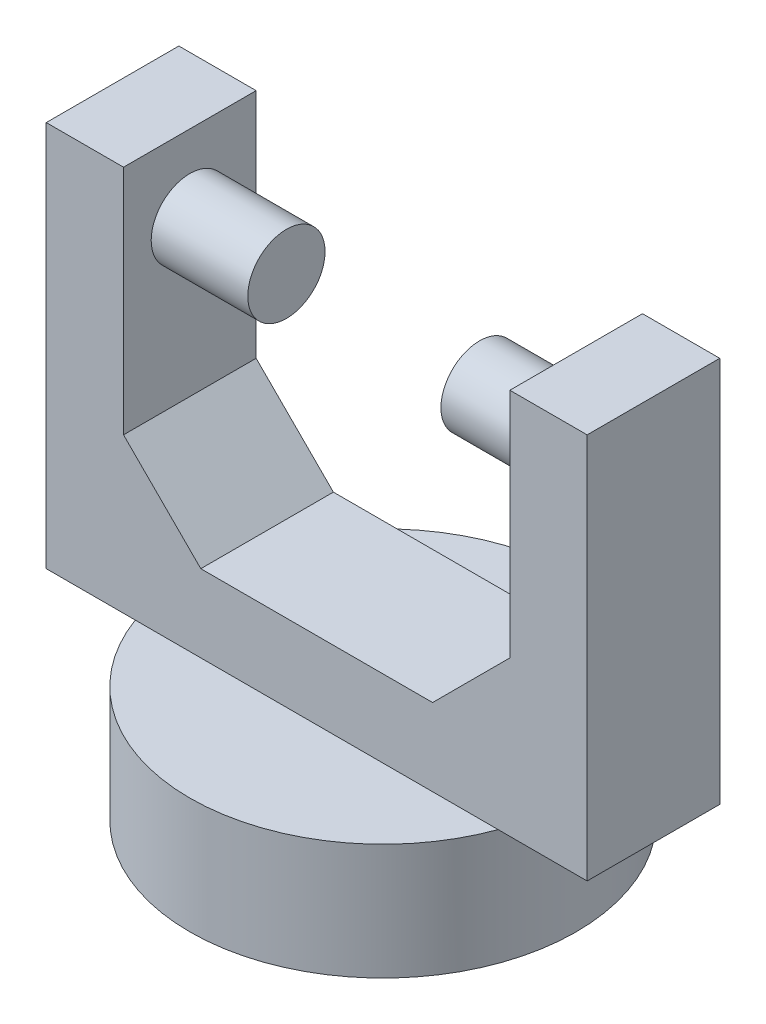
ISO-10303-21;
HEADER;
FILE_DESCRIPTION(('STEP AP214'),'2;1');
FILE_NAME('part.step','',(''),(''),'','','');
FILE_SCHEMA(('AUTOMOTIVE_DESIGN { 1 0 10303 214 1 1 1 1 }'));
ENDSEC;
DATA;
#1=APPLICATION_CONTEXT('core data for automotive mechanical design processes');
#2=APPLICATION_PROTOCOL_DEFINITION('international standard','automotive_design',2000,#1);
#3=PRODUCT_CONTEXT('',#1,'mechanical');
#4=PRODUCT('Part','Part','',(#3));
#5=PRODUCT_RELATED_PRODUCT_CATEGORY('part','',(#4));
#6=PRODUCT_DEFINITION_FORMATION('','',#4);
#7=PRODUCT_DEFINITION_CONTEXT('part definition',#1,'design');
#8=PRODUCT_DEFINITION('design','',#6,#7);
#9=PRODUCT_DEFINITION_SHAPE('','',#8);
#10=(LENGTH_UNIT() NAMED_UNIT(*) SI_UNIT(.MILLI.,.METRE.));
#11=(NAMED_UNIT(*) PLANE_ANGLE_UNIT() SI_UNIT($,.RADIAN.));
#12=(NAMED_UNIT(*) SI_UNIT($,.STERADIAN.) SOLID_ANGLE_UNIT());
#13=UNCERTAINTY_MEASURE_WITH_UNIT(LENGTH_MEASURE(1.E-05),#10,'distance_accuracy_value','');
#14=(GEOMETRIC_REPRESENTATION_CONTEXT(3) GLOBAL_UNCERTAINTY_ASSIGNED_CONTEXT((#13)) GLOBAL_UNIT_ASSIGNED_CONTEXT((#10,
#11,#12)) REPRESENTATION_CONTEXT('',''));
#15=CARTESIAN_POINT('',(0.,0.,0.));
#16=DIRECTION('',(0.,0.,1.));
#17=DIRECTION('',(1.,0.,0.));
#18=AXIS2_PLACEMENT_3D('',#15,#16,#17);
#19=CARTESIAN_POINT('',(0.,32.5,0.));
#20=DIRECTION('',(0.,1.,0.));
#21=DIRECTION('',(0.,0.,1.));
#22=AXIS2_PLACEMENT_3D('',#19,#20,#21);
#23=PLANE('',#22);
#24=DIRECTION('',(0.,0.,1.));
#25=VECTOR('',#24,1.);
#26=CARTESIAN_POINT('',(-12.5,32.5,-4.29038395748194));
#27=LINE('',#26,#25);
#28=CARTESIAN_POINT('',(-12.5,32.5,-4.29038395748194));
#29=VERTEX_POINT('',#28);
#30=CARTESIAN_POINT('',(-12.5,32.5,4.29038395748193));
#31=VERTEX_POINT('',#30);
#32=EDGE_CURVE('E142',#29,#31,#27,.T.);
#33=ORIENTED_EDGE('',*,*,#32,.F.);
#34=DIRECTION('',(-1.,0.,0.));
#35=VECTOR('',#34,1.);
#36=CARTESIAN_POINT('',(-17.5,32.5,-4.29038395748194));
#37=LINE('',#36,#35);
#38=CARTESIAN_POINT('',(-17.5,32.5,-4.29038395748194));
#39=VERTEX_POINT('',#38);
#40=EDGE_CURVE('E161',#29,#39,#37,.T.);
#41=ORIENTED_EDGE('',*,*,#40,.T.);
#42=DIRECTION('',(0.,0.,1.));
#43=VECTOR('',#42,1.);
#44=CARTESIAN_POINT('',(-17.5,32.5,-4.29038395748194));
#45=LINE('',#44,#43);
#46=CARTESIAN_POINT('',(-17.5,32.5,4.29038395748193));
#47=VERTEX_POINT('',#46);
#48=EDGE_CURVE('E153',#39,#47,#45,.T.);
#49=ORIENTED_EDGE('',*,*,#48,.T.);
#50=DIRECTION('',(1.,0.,0.));
#51=VECTOR('',#50,1.);
#52=CARTESIAN_POINT('',(-17.5,32.5,4.29038395748193));
#53=LINE('',#52,#51);
#54=EDGE_CURVE('E132',#47,#31,#53,.T.);
#55=ORIENTED_EDGE('',*,*,#54,.T.);
#56=EDGE_LOOP('',(#33,#41,#49,#55));
#57=FACE_BOUND('',#56,.T.);
#58=ADVANCED_FACE('F39',(#57),#23,.T.);
#59=CARTESIAN_POINT('',(0.,7.5,0.));
#60=DIRECTION('',(0.,1.,0.));
#61=DIRECTION('',(0.,0.,1.));
#62=AXIS2_PLACEMENT_3D('',#59,#60,#61);
#63=PLANE('',#62);
#64=DIRECTION('',(-1.,0.,0.));
#65=VECTOR('',#64,1.);
#66=CARTESIAN_POINT('',(-17.5,7.5,-4.29038395748194));
#67=LINE('',#66,#65);
#68=CARTESIAN_POINT('',(11.7406390583044,7.5,-4.29038395748194));
#69=VERTEX_POINT('',#68);
#70=CARTESIAN_POINT('',(-11.7406390583044,7.5,-4.29038395748194));
#71=VERTEX_POINT('',#70);
#72=EDGE_CURVE('E188',#69,#71,#67,.T.);
#73=ORIENTED_EDGE('',*,*,#72,.F.);
#74=CARTESIAN_POINT('',(0.,7.5,0.));
#75=DIRECTION('',(0.,1.,0.));
#76=DIRECTION('',(0.,0.,1.));
#77=AXIS2_PLACEMENT_3D('',#74,#75,#76);
#78=CIRCLE('',#77,12.5);
#79=EDGE_CURVE('E208',#69,#71,#78,.T.);
#80=ORIENTED_EDGE('',*,*,#79,.T.);
#81=EDGE_LOOP('',(#73,#80));
#82=FACE_BOUND('',#81,.T.);
#83=ADVANCED_FACE('F318',(#82),#63,.T.);
#84=CARTESIAN_POINT('',(0.,7.5,0.));
#85=DIRECTION('',(0.,-1.,0.));
#86=DIRECTION('',(0.,0.,-1.));
#87=AXIS2_PLACEMENT_3D('',#84,#85,#86);
#88=CYLINDRICAL_SURFACE('',#87,12.5);
#89=CARTESIAN_POINT('',(11.7406390583043,7.5,4.29038395748194));
#90=VERTEX_POINT('',#89);
#91=EDGE_CURVE('E204',#90,#69,#78,.T.);
#92=ORIENTED_EDGE('',*,*,#91,.F.);
#93=CARTESIAN_POINT('',(-11.7406390583044,7.5,4.29038395748193));
#94=VERTEX_POINT('',#93);
#95=EDGE_CURVE('E209',#94,#90,#78,.T.);
#96=ORIENTED_EDGE('',*,*,#95,.F.);
#97=EDGE_CURVE('E247',#71,#94,#78,.T.);
#98=ORIENTED_EDGE('',*,*,#97,.F.);
#99=ORIENTED_EDGE('',*,*,#79,.F.);
#100=EDGE_LOOP('',(#92,#96,#98,#99));
#101=FACE_BOUND('',#100,.T.);
#102=CARTESIAN_POINT('',(0.,0.,0.));
#103=DIRECTION('',(0.,1.,0.));
#104=DIRECTION('',(0.,0.,1.));
#105=AXIS2_PLACEMENT_3D('',#102,#103,#104);
#106=CIRCLE('',#105,12.5);
#107=CARTESIAN_POINT('',(0.,0.,12.5));
#108=VERTEX_POINT('',#107);
#109=EDGE_CURVE('E203',#108,#108,#106,.T.);
#110=ORIENTED_EDGE('',*,*,#109,.T.);
#111=EDGE_LOOP('',(#110));
#112=FACE_BOUND('',#111,.T.);
#113=ADVANCED_FACE('F324',(#101,#112),#88,.T.);
#114=DIRECTION('',(1.,0.,0.));
#115=VECTOR('',#114,1.);
#116=CARTESIAN_POINT('',(-17.5,7.5,4.29038395748193));
#117=LINE('',#116,#115);
#118=EDGE_CURVE('E180',#94,#90,#117,.T.);
#119=ORIENTED_EDGE('',*,*,#118,.F.);
#120=ORIENTED_EDGE('',*,*,#95,.T.);
#121=EDGE_LOOP('',(#119,#120));
#122=FACE_BOUND('',#121,.T.);
#123=ADVANCED_FACE('F327',(#122),#63,.T.);
#124=CARTESIAN_POINT('',(0.,0.,0.));
#125=DIRECTION('',(0.,1.,0.));
#126=DIRECTION('',(0.,0.,1.));
#127=AXIS2_PLACEMENT_3D('',#124,#125,#126);
#128=PLANE('',#127);
#129=ORIENTED_EDGE('',*,*,#109,.F.);
#130=EDGE_LOOP('',(#129));
#131=FACE_BOUND('',#130,.T.);
#132=ADVANCED_FACE('F361',(#131),#128,.F.);
#133=CARTESIAN_POINT('',(0.,7.5,0.));
#134=DIRECTION('',(0.,1.,0.));
#135=DIRECTION('',(0.,0.,1.));
#136=AXIS2_PLACEMENT_3D('',#133,#134,#135);
#137=PLANE('',#136);
#138=CARTESIAN_POINT('',(17.5,7.5,4.29038395748194));
#139=VERTEX_POINT('',#138);
#140=EDGE_CURVE('E174',#90,#139,#117,.T.);
#141=ORIENTED_EDGE('',*,*,#140,.F.);
#142=ORIENTED_EDGE('',*,*,#91,.T.);
#143=CARTESIAN_POINT('',(17.5,7.5,-4.29038395748194));
#144=VERTEX_POINT('',#143);
#145=EDGE_CURVE('E184',#144,#69,#67,.T.);
#146=ORIENTED_EDGE('',*,*,#145,.F.);
#147=DIRECTION('',(0.,0.,-1.));
#148=VECTOR('',#147,1.);
#149=CARTESIAN_POINT('',(17.5,7.5,-4.29038395748194));
#150=LINE('',#149,#148);
#151=EDGE_CURVE('E179',#139,#144,#150,.T.);
#152=ORIENTED_EDGE('',*,*,#151,.F.);
#153=EDGE_LOOP('',(#141,#142,#146,#152));
#154=FACE_BOUND('',#153,.T.);
#155=ADVANCED_FACE('F347',(#154),#137,.F.);
#156=CARTESIAN_POINT('',(-17.5,7.5,-4.29038395748194));
#157=VERTEX_POINT('',#156);
#158=EDGE_CURVE('E183',#71,#157,#67,.T.);
#159=ORIENTED_EDGE('',*,*,#158,.F.);
#160=ORIENTED_EDGE('',*,*,#97,.T.);
#161=CARTESIAN_POINT('',(-17.5,7.5,4.29038395748193));
#162=VERTEX_POINT('',#161);
#163=EDGE_CURVE('E175',#162,#94,#117,.T.);
#164=ORIENTED_EDGE('',*,*,#163,.F.);
#165=DIRECTION('',(0.,0.,1.));
#166=VECTOR('',#165,1.);
#167=CARTESIAN_POINT('',(-17.5,7.5,-4.29038395748194));
#168=LINE('',#167,#166);
#169=EDGE_CURVE('E170',#157,#162,#168,.T.);
#170=ORIENTED_EDGE('',*,*,#169,.F.);
#171=EDGE_LOOP('',(#159,#160,#164,#170));
#172=FACE_BOUND('',#171,.T.);
#173=ADVANCED_FACE('F354',(#172),#137,.F.);
#174=CARTESIAN_POINT('',(-17.5,32.5,-4.29038395748194));
#175=DIRECTION('',(1.,0.,0.));
#176=DIRECTION('',(0.,0.,-1.));
#177=AXIS2_PLACEMENT_3D('',#174,#175,#176);
#178=PLANE('',#177);
#179=ORIENTED_EDGE('',*,*,#169,.T.);
#180=DIRECTION('',(0.,-1.,0.));
#181=VECTOR('',#180,1.);
#182=CARTESIAN_POINT('',(-17.5,32.5,4.29038395748193));
#183=LINE('',#182,#181);
#184=EDGE_CURVE('E200',#47,#162,#183,.T.);
#185=ORIENTED_EDGE('',*,*,#184,.F.);
#186=ORIENTED_EDGE('',*,*,#48,.F.);
#187=DIRECTION('',(0.,-1.,0.));
#188=VECTOR('',#187,1.);
#189=CARTESIAN_POINT('',(-17.5,32.5,-4.29038395748194));
#190=LINE('',#189,#188);
#191=EDGE_CURVE('E169',#39,#157,#190,.T.);
#192=ORIENTED_EDGE('',*,*,#191,.T.);
#193=EDGE_LOOP('',(#179,#185,#186,#192));
#194=FACE_BOUND('',#193,.T.);
#195=ADVANCED_FACE('F257',(#194),#178,.F.);
#196=CARTESIAN_POINT('',(-17.5,32.5,4.29038395748193));
#197=DIRECTION('',(0.,0.,-1.));
#198=DIRECTION('',(-1.,0.,0.));
#199=AXIS2_PLACEMENT_3D('',#196,#197,#198);
#200=PLANE('',#199);
#201=DIRECTION('',(1.,0.,0.));
#202=VECTOR('',#201,1.);
#203=CARTESIAN_POINT('',(-12.5,12.5,4.29038395748193));
#204=LINE('',#203,#202);
#205=CARTESIAN_POINT('',(-7.49999999999997,12.5,4.29038395748193));
#206=VERTEX_POINT('',#205);
#207=CARTESIAN_POINT('',(7.49999999999997,12.5,4.29038395748193));
#208=VERTEX_POINT('',#207);
#209=EDGE_CURVE('E270',#206,#208,#204,.T.);
#210=ORIENTED_EDGE('',*,*,#209,.F.);
#211=DIRECTION('',(-0.707106781186551,0.707106781186544,0.));
#212=VECTOR('',#211,1.);
#213=CARTESIAN_POINT('',(-22.5,27.4999999999999,4.29038395748193));
#214=LINE('',#213,#212);
#215=CARTESIAN_POINT('',(-12.5,17.5,4.29038395748193));
#216=VERTEX_POINT('',#215);
#217=EDGE_CURVE('E134',#206,#216,#214,.T.);
#218=ORIENTED_EDGE('',*,*,#217,.T.);
#219=DIRECTION('',(0.,1.,0.));
#220=VECTOR('',#219,1.);
#221=CARTESIAN_POINT('',(-12.5,12.5,4.29038395748193));
#222=LINE('',#221,#220);
#223=EDGE_CURVE('E126',#216,#31,#222,.T.);
#224=ORIENTED_EDGE('',*,*,#223,.T.);
#225=ORIENTED_EDGE('',*,*,#54,.F.);
#226=ORIENTED_EDGE('',*,*,#184,.T.);
#227=ORIENTED_EDGE('',*,*,#163,.T.);
#228=ORIENTED_EDGE('',*,*,#118,.T.);
#229=ORIENTED_EDGE('',*,*,#140,.T.);
#230=DIRECTION('',(0.,-1.,0.));
#231=VECTOR('',#230,1.);
#232=CARTESIAN_POINT('',(17.5,32.5,4.29038395748194));
#233=LINE('',#232,#231);
#234=CARTESIAN_POINT('',(17.5,32.5,4.29038395748194));
#235=VERTEX_POINT('',#234);
#236=EDGE_CURVE('E196',#235,#139,#233,.T.);
#237=ORIENTED_EDGE('',*,*,#236,.F.);
#238=CARTESIAN_POINT('',(12.5,32.5,4.29038395748194));
#239=VERTEX_POINT('',#238);
#240=EDGE_CURVE('E157',#239,#235,#53,.T.);
#241=ORIENTED_EDGE('',*,*,#240,.F.);
#242=DIRECTION('',(0.,1.,0.));
#243=VECTOR('',#242,1.);
#244=CARTESIAN_POINT('',(12.5,12.5,4.29038395748193));
#245=LINE('',#244,#243);
#246=CARTESIAN_POINT('',(12.5,17.5,4.29038395748193));
#247=VERTEX_POINT('',#246);
#248=EDGE_CURVE('E138',#247,#239,#245,.T.);
#249=ORIENTED_EDGE('',*,*,#248,.F.);
#250=DIRECTION('',(-0.707106781186551,-0.707106781186544,0.));
#251=VECTOR('',#250,1.);
#252=CARTESIAN_POINT('',(4.99999999999987,9.99999999999991,4.29038395748193));
#253=LINE('',#252,#251);
#254=EDGE_CURVE('E11',#247,#208,#253,.T.);
#255=ORIENTED_EDGE('',*,*,#254,.T.);
#256=EDGE_LOOP('',(#210,#218,#224,#225,#226,#227,#228,#229,#237,#241,#249,#255));
#257=FACE_BOUND('',#256,.T.);
#258=ADVANCED_FACE('F129',(#257),#200,.F.);
#259=CARTESIAN_POINT('',(17.5,32.5,-4.29038395748194));
#260=DIRECTION('',(-1.,0.,0.));
#261=DIRECTION('',(0.,0.,1.));
#262=AXIS2_PLACEMENT_3D('',#259,#260,#261);
#263=PLANE('',#262);
#264=ORIENTED_EDGE('',*,*,#151,.T.);
#265=DIRECTION('',(0.,-1.,0.));
#266=VECTOR('',#265,1.);
#267=CARTESIAN_POINT('',(17.5,32.5,-4.29038395748194));
#268=LINE('',#267,#266);
#269=CARTESIAN_POINT('',(17.5,32.5,-4.29038395748194));
#270=VERTEX_POINT('',#269);
#271=EDGE_CURVE('E192',#270,#144,#268,.T.);
#272=ORIENTED_EDGE('',*,*,#271,.F.);
#273=DIRECTION('',(0.,0.,-1.));
#274=VECTOR('',#273,1.);
#275=CARTESIAN_POINT('',(17.5,32.5,-4.29038395748194));
#276=LINE('',#275,#274);
#277=EDGE_CURVE('E156',#235,#270,#276,.T.);
#278=ORIENTED_EDGE('',*,*,#277,.F.);
#279=ORIENTED_EDGE('',*,*,#236,.T.);
#280=EDGE_LOOP('',(#264,#272,#278,#279));
#281=FACE_BOUND('',#280,.T.);
#282=ADVANCED_FACE('F337',(#281),#263,.F.);
#283=CARTESIAN_POINT('',(-17.5,32.5,-4.29038395748194));
#284=DIRECTION('',(0.,0.,1.));
#285=DIRECTION('',(1.,0.,0.));
#286=AXIS2_PLACEMENT_3D('',#283,#284,#285);
#287=PLANE('',#286);
#288=ORIENTED_EDGE('',*,*,#40,.F.);
#289=DIRECTION('',(0.,1.,0.));
#290=VECTOR('',#289,1.);
#291=CARTESIAN_POINT('',(-12.5,12.5,-4.29038395748194));
#292=LINE('',#291,#290);
#293=CARTESIAN_POINT('',(-12.5,17.5,-4.29038395748194));
#294=VERTEX_POINT('',#293);
#295=EDGE_CURVE('E145',#294,#29,#292,.T.);
#296=ORIENTED_EDGE('',*,*,#295,.F.);
#297=DIRECTION('',(0.707106781186551,-0.707106781186544,0.));
#298=VECTOR('',#297,1.);
#299=CARTESIAN_POINT('',(-22.5,27.4999999999999,-4.29038395748194));
#300=LINE('',#299,#298);
#301=CARTESIAN_POINT('',(-7.49999999999997,12.5,-4.29038395748194));
#302=VERTEX_POINT('',#301);
#303=EDGE_CURVE('E230',#294,#302,#300,.T.);
#304=ORIENTED_EDGE('',*,*,#303,.T.);
#305=DIRECTION('',(-1.,0.,0.));
#306=VECTOR('',#305,1.);
#307=CARTESIAN_POINT('',(-12.5,12.5,-4.29038395748194));
#308=LINE('',#307,#306);
#309=CARTESIAN_POINT('',(7.49999999999996,12.5,-4.29038395748194));
#310=VERTEX_POINT('',#309);
#311=EDGE_CURVE('E139',#310,#302,#308,.T.);
#312=ORIENTED_EDGE('',*,*,#311,.F.);
#313=DIRECTION('',(0.707106781186551,0.707106781186544,0.));
#314=VECTOR('',#313,1.);
#315=CARTESIAN_POINT('',(4.99999999999987,9.99999999999991,-4.29038395748194));
#316=LINE('',#315,#314);
#317=CARTESIAN_POINT('',(12.5,17.5,-4.29038395748194));
#318=VERTEX_POINT('',#317);
#319=EDGE_CURVE('E48',#310,#318,#316,.T.);
#320=ORIENTED_EDGE('',*,*,#319,.T.);
#321=DIRECTION('',(0.,1.,0.));
#322=VECTOR('',#321,1.);
#323=CARTESIAN_POINT('',(12.5,12.5,-4.29038395748194));
#324=LINE('',#323,#322);
#325=CARTESIAN_POINT('',(12.5,32.5,-4.29038395748194));
#326=VERTEX_POINT('',#325);
#327=EDGE_CURVE('E263',#318,#326,#324,.T.);
#328=ORIENTED_EDGE('',*,*,#327,.T.);
#329=EDGE_CURVE('E165',#270,#326,#37,.T.);
#330=ORIENTED_EDGE('',*,*,#329,.F.);
#331=ORIENTED_EDGE('',*,*,#271,.T.);
#332=ORIENTED_EDGE('',*,*,#145,.T.);
#333=ORIENTED_EDGE('',*,*,#72,.T.);
#334=ORIENTED_EDGE('',*,*,#158,.T.);
#335=ORIENTED_EDGE('',*,*,#191,.F.);
#336=EDGE_LOOP('',(#288,#296,#304,#312,#320,#328,#330,#331,#332,#333,#334,#335));
#337=FACE_BOUND('',#336,.T.);
#338=ADVANCED_FACE('F253',(#337),#287,.F.);
#339=DIRECTION('',(0.,0.,-1.));
#340=VECTOR('',#339,1.);
#341=CARTESIAN_POINT('',(12.5,32.5,-4.29038395748194));
#342=LINE('',#341,#340);
#343=EDGE_CURVE('E149',#239,#326,#342,.T.);
#344=ORIENTED_EDGE('',*,*,#343,.F.);
#345=ORIENTED_EDGE('',*,*,#240,.T.);
#346=ORIENTED_EDGE('',*,*,#277,.T.);
#347=ORIENTED_EDGE('',*,*,#329,.T.);
#348=EDGE_LOOP('',(#344,#345,#346,#347));
#349=FACE_BOUND('',#348,.T.);
#350=ADVANCED_FACE('F320',(#349),#23,.T.);
#351=CARTESIAN_POINT('',(-12.5,12.5,-4.29038395748194));
#352=DIRECTION('',(-1.,0.,0.));
#353=DIRECTION('',(0.,0.,1.));
#354=AXIS2_PLACEMENT_3D('',#351,#352,#353);
#355=PLANE('',#354);
#356=CARTESIAN_POINT('',(-12.5,27.5,0.));
#357=DIRECTION('',(-1.,0.,0.));
#358=DIRECTION('',(0.,0.,1.));
#359=AXIS2_PLACEMENT_3D('',#356,#357,#358);
#360=CIRCLE('',#359,2.5);
#361=CARTESIAN_POINT('',(-12.5,27.5,2.5));
#362=VERTEX_POINT('',#361);
#363=EDGE_CURVE('E213',#362,#362,#360,.F.);
#364=ORIENTED_EDGE('',*,*,#363,.F.);
#365=EDGE_LOOP('',(#364));
#366=FACE_BOUND('',#365,.T.);
#367=ORIENTED_EDGE('',*,*,#223,.F.);
#368=DIRECTION('',(0.,0.,-1.));
#369=VECTOR('',#368,1.);
#370=CARTESIAN_POINT('',(-12.5,17.5,-4.29038395748194));
#371=LINE('',#370,#369);
#372=EDGE_CURVE('E225',#216,#294,#371,.T.);
#373=ORIENTED_EDGE('',*,*,#372,.T.);
#374=ORIENTED_EDGE('',*,*,#295,.T.);
#375=ORIENTED_EDGE('',*,*,#32,.T.);
#376=EDGE_LOOP('',(#367,#373,#374,#375));
#377=FACE_BOUND('',#376,.T.);
#378=ADVANCED_FACE('F143',(#366,#377),#355,.F.);
#379=CARTESIAN_POINT('',(12.5,12.5,-4.29038395748194));
#380=DIRECTION('',(1.,0.,0.));
#381=DIRECTION('',(0.,0.,-1.));
#382=AXIS2_PLACEMENT_3D('',#379,#380,#381);
#383=PLANE('',#382);
#384=CARTESIAN_POINT('',(12.5,27.5,0.));
#385=DIRECTION('',(1.,0.,0.));
#386=DIRECTION('',(0.,0.,-1.));
#387=AXIS2_PLACEMENT_3D('',#384,#385,#386);
#388=CIRCLE('',#387,2.5);
#389=CARTESIAN_POINT('',(12.5,27.5,-2.5));
#390=VERTEX_POINT('',#389);
#391=EDGE_CURVE('E217',#390,#390,#388,.F.);
#392=ORIENTED_EDGE('',*,*,#391,.F.);
#393=EDGE_LOOP('',(#392));
#394=FACE_BOUND('',#393,.T.);
#395=ORIENTED_EDGE('',*,*,#327,.F.);
#396=DIRECTION('',(0.,0.,1.));
#397=VECTOR('',#396,1.);
#398=CARTESIAN_POINT('',(12.5,17.5,-4.29038395748194));
#399=LINE('',#398,#397);
#400=EDGE_CURVE('E55',#318,#247,#399,.T.);
#401=ORIENTED_EDGE('',*,*,#400,.T.);
#402=ORIENTED_EDGE('',*,*,#248,.T.);
#403=ORIENTED_EDGE('',*,*,#343,.T.);
#404=EDGE_LOOP('',(#395,#401,#402,#403));
#405=FACE_BOUND('',#404,.T.);
#406=ADVANCED_FACE('F295',(#394,#405),#383,.F.);
#407=CARTESIAN_POINT('',(0.,12.5,0.));
#408=DIRECTION('',(0.,1.,0.));
#409=DIRECTION('',(0.,0.,1.));
#410=AXIS2_PLACEMENT_3D('',#407,#408,#409);
#411=PLANE('',#410);
#412=ORIENTED_EDGE('',*,*,#209,.T.);
#413=DIRECTION('',(0.,0.,-1.));
#414=VECTOR('',#413,1.);
#415=CARTESIAN_POINT('',(7.49999999999997,12.5,0.));
#416=LINE('',#415,#414);
#417=EDGE_CURVE('E234',#208,#310,#416,.T.);
#418=ORIENTED_EDGE('',*,*,#417,.T.);
#419=ORIENTED_EDGE('',*,*,#311,.T.);
#420=DIRECTION('',(0.,0.,1.));
#421=VECTOR('',#420,1.);
#422=CARTESIAN_POINT('',(-7.49999999999997,12.5,0.));
#423=LINE('',#422,#421);
#424=EDGE_CURVE('E221',#302,#206,#423,.T.);
#425=ORIENTED_EDGE('',*,*,#424,.T.);
#426=EDGE_LOOP('',(#412,#418,#419,#425));
#427=FACE_BOUND('',#426,.T.);
#428=ADVANCED_FACE('F297',(#427),#411,.T.);
#429=CARTESIAN_POINT('',(-6.25,27.5,0.));
#430=DIRECTION('',(-1.,0.,0.));
#431=DIRECTION('',(0.,0.,1.));
#432=AXIS2_PLACEMENT_3D('',#429,#430,#431);
#433=CYLINDRICAL_SURFACE('',#432,2.5);
#434=CARTESIAN_POINT('',(-6.25,27.5,0.));
#435=DIRECTION('',(1.,0.,0.));
#436=DIRECTION('',(0.,0.,-1.));
#437=AXIS2_PLACEMENT_3D('',#434,#435,#436);
#438=CIRCLE('',#437,2.5);
#439=CARTESIAN_POINT('',(-6.25,27.5,-2.5));
#440=VERTEX_POINT('',#439);
#441=EDGE_CURVE('E150',#440,#440,#438,.T.);
#442=ORIENTED_EDGE('',*,*,#441,.F.);
#443=EDGE_LOOP('',(#442));
#444=FACE_BOUND('',#443,.T.);
#445=ORIENTED_EDGE('',*,*,#363,.T.);
#446=EDGE_LOOP('',(#445));
#447=FACE_BOUND('',#446,.T.);
#448=ADVANCED_FACE('F420',(#444,#447),#433,.T.);
#449=CARTESIAN_POINT('',(-6.25,27.5,0.));
#450=DIRECTION('',(1.,0.,0.));
#451=DIRECTION('',(0.,0.,-1.));
#452=AXIS2_PLACEMENT_3D('',#449,#450,#451);
#453=PLANE('',#452);
#454=ORIENTED_EDGE('',*,*,#441,.T.);
#455=EDGE_LOOP('',(#454));
#456=FACE_BOUND('',#455,.T.);
#457=ADVANCED_FACE('F291',(#456),#453,.T.);
#458=CARTESIAN_POINT('',(6.25,27.5,0.));
#459=DIRECTION('',(1.,0.,0.));
#460=DIRECTION('',(0.,0.,-1.));
#461=AXIS2_PLACEMENT_3D('',#458,#459,#460);
#462=CYLINDRICAL_SURFACE('',#461,2.5);
#463=CARTESIAN_POINT('',(6.25,27.5,0.));
#464=DIRECTION('',(-1.,0.,0.));
#465=DIRECTION('',(0.,0.,1.));
#466=AXIS2_PLACEMENT_3D('',#463,#464,#465);
#467=CIRCLE('',#466,2.5);
#468=CARTESIAN_POINT('',(6.25,27.5,2.5));
#469=VERTEX_POINT('',#468);
#470=EDGE_CURVE('E280',#469,#469,#467,.T.);
#471=ORIENTED_EDGE('',*,*,#470,.F.);
#472=EDGE_LOOP('',(#471));
#473=FACE_BOUND('',#472,.T.);
#474=ORIENTED_EDGE('',*,*,#391,.T.);
#475=EDGE_LOOP('',(#474));
#476=FACE_BOUND('',#475,.T.);
#477=ADVANCED_FACE('F288',(#473,#476),#462,.T.);
#478=CARTESIAN_POINT('',(6.25,27.5,0.));
#479=DIRECTION('',(-1.,0.,0.));
#480=DIRECTION('',(0.,0.,1.));
#481=AXIS2_PLACEMENT_3D('',#478,#479,#480);
#482=PLANE('',#481);
#483=ORIENTED_EDGE('',*,*,#470,.T.);
#484=EDGE_LOOP('',(#483));
#485=FACE_BOUND('',#484,.T.);
#486=ADVANCED_FACE('F286',(#485),#482,.T.);
#487=CARTESIAN_POINT('',(-7.49999999999997,12.5,0.));
#488=DIRECTION('',(-0.707106781186544,-0.707106781186551,0.));
#489=DIRECTION('',(0.,0.,1.));
#490=AXIS2_PLACEMENT_3D('',#487,#488,#489);
#491=PLANE('',#490);
#492=ORIENTED_EDGE('',*,*,#303,.F.);
#493=ORIENTED_EDGE('',*,*,#372,.F.);
#494=ORIENTED_EDGE('',*,*,#217,.F.);
#495=ORIENTED_EDGE('',*,*,#424,.F.);
#496=EDGE_LOOP('',(#492,#493,#494,#495));
#497=FACE_BOUND('',#496,.T.);
#498=ADVANCED_FACE('F309',(#497),#491,.F.);
#499=CARTESIAN_POINT('',(7.49999999999997,12.5,0.));
#500=DIRECTION('',(0.707106781186544,-0.707106781186551,0.));
#501=DIRECTION('',(0.,0.,-1.));
#502=AXIS2_PLACEMENT_3D('',#499,#500,#501);
#503=PLANE('',#502);
#504=ORIENTED_EDGE('',*,*,#254,.F.);
#505=ORIENTED_EDGE('',*,*,#400,.F.);
#506=ORIENTED_EDGE('',*,*,#319,.F.);
#507=ORIENTED_EDGE('',*,*,#417,.F.);
#508=EDGE_LOOP('',(#504,#505,#506,#507));
#509=FACE_BOUND('',#508,.T.);
#510=ADVANCED_FACE('F41',(#509),#503,.F.);
#511=CLOSED_SHELL('',(#58,#83,#113,#123,#132,#155,#173,#195,#258,#282,#338,#350,#378,#406,#428,
#448,#457,#477,#486,#498,#510));
#512=MANIFOLD_SOLID_BREP('B2',#511);
#513=ADVANCED_BREP_SHAPE_REPRESENTATION('',(#18,#512),#14);
#514=SHAPE_DEFINITION_REPRESENTATION(#9,#513);
ENDSEC;
END-ISO-10303-21;
